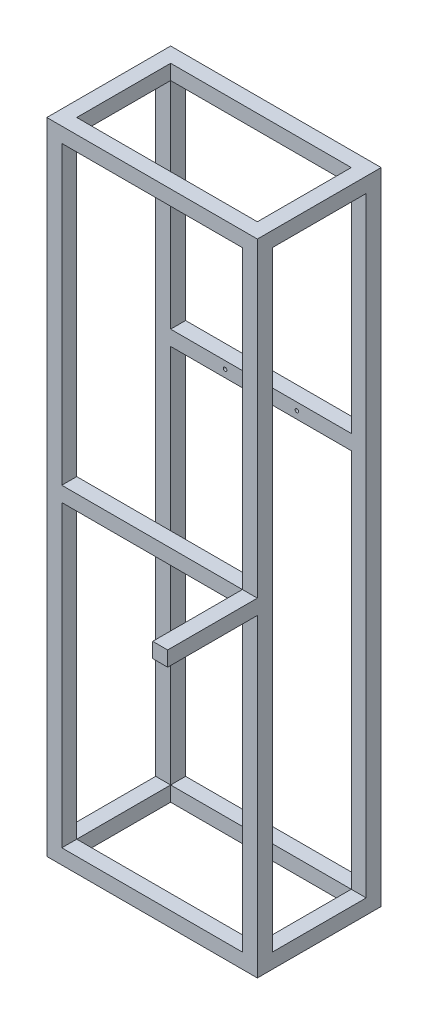
ISO-10303-21;
HEADER;
FILE_DESCRIPTION(('STEP AP214'),'2;1');
FILE_NAME('part.step','',(''),(''),'','','');
FILE_SCHEMA(('AUTOMOTIVE_DESIGN { 1 0 10303 214 1 1 1 1 }'));
ENDSEC;
DATA;
#1=APPLICATION_CONTEXT('core data for automotive mechanical design processes');
#2=APPLICATION_PROTOCOL_DEFINITION('international standard','automotive_design',2000,#1);
#3=PRODUCT_CONTEXT('',#1,'mechanical');
#4=PRODUCT('Part','Part','',(#3));
#5=PRODUCT_RELATED_PRODUCT_CATEGORY('part','',(#4));
#6=PRODUCT_DEFINITION_FORMATION('','',#4);
#7=PRODUCT_DEFINITION_CONTEXT('part definition',#1,'design');
#8=PRODUCT_DEFINITION('design','',#6,#7);
#9=PRODUCT_DEFINITION_SHAPE('','',#8);
#10=(LENGTH_UNIT() NAMED_UNIT(*) SI_UNIT(.MILLI.,.METRE.));
#11=(NAMED_UNIT(*) PLANE_ANGLE_UNIT() SI_UNIT($,.RADIAN.));
#12=(NAMED_UNIT(*) SI_UNIT($,.STERADIAN.) SOLID_ANGLE_UNIT());
#13=UNCERTAINTY_MEASURE_WITH_UNIT(LENGTH_MEASURE(1.E-05),#10,'distance_accuracy_value','');
#14=(GEOMETRIC_REPRESENTATION_CONTEXT(3) GLOBAL_UNCERTAINTY_ASSIGNED_CONTEXT((#13)) GLOBAL_UNIT_ASSIGNED_CONTEXT((#10,
#11,#12)) REPRESENTATION_CONTEXT('',''));
#15=CARTESIAN_POINT('',(0.,0.,0.));
#16=DIRECTION('',(0.,0.,1.));
#17=DIRECTION('',(1.,0.,0.));
#18=AXIS2_PLACEMENT_3D('',#15,#16,#17);
#19=CARTESIAN_POINT('',(0.,25.,0.));
#20=DIRECTION('',(0.,0.,-1.));
#21=DIRECTION('',(-1.,0.,0.));
#22=AXIS2_PLACEMENT_3D('',#19,#20,#21);
#23=PLANE('',#22);
#24=DIRECTION('',(-1.,0.,0.));
#25=VECTOR('',#24,1.);
#26=CARTESIAN_POINT('',(327.,550.,0.));
#27=LINE('',#26,#25);
#28=CARTESIAN_POINT('',(352.,550.,0.));
#29=VERTEX_POINT('',#28);
#30=CARTESIAN_POINT('',(327.,550.,0.));
#31=VERTEX_POINT('',#30);
#32=EDGE_CURVE('E50',#29,#31,#27,.T.);
#33=ORIENTED_EDGE('',*,*,#32,.F.);
#34=DIRECTION('',(0.,-1.,0.));
#35=VECTOR('',#34,1.);
#36=CARTESIAN_POINT('',(352.,25.,0.));
#37=LINE('',#36,#35);
#38=CARTESIAN_POINT('',(352.,1070.,0.));
#39=VERTEX_POINT('',#38);
#40=EDGE_CURVE('E510',#39,#29,#37,.T.);
#41=ORIENTED_EDGE('',*,*,#40,.F.);
#42=DIRECTION('',(1.,0.,0.));
#43=VECTOR('',#42,1.);
#44=CARTESIAN_POINT('',(0.,1070.,0.));
#45=LINE('',#44,#43);
#46=CARTESIAN_POINT('',(0.,1070.,0.));
#47=VERTEX_POINT('',#46);
#48=EDGE_CURVE('E409',#47,#39,#45,.T.);
#49=ORIENTED_EDGE('',*,*,#48,.F.);
#50=DIRECTION('',(0.,-1.,0.));
#51=VECTOR('',#50,1.);
#52=CARTESIAN_POINT('',(0.,25.,0.));
#53=LINE('',#52,#51);
#54=CARTESIAN_POINT('',(0.,0.,0.));
#55=VERTEX_POINT('',#54);
#56=EDGE_CURVE('E43',#47,#55,#53,.T.);
#57=ORIENTED_EDGE('',*,*,#56,.T.);
#58=DIRECTION('',(1.,0.,0.));
#59=VECTOR('',#58,1.);
#60=CARTESIAN_POINT('',(0.,0.,0.));
#61=LINE('',#60,#59);
#62=CARTESIAN_POINT('',(352.,0.,0.));
#63=VERTEX_POINT('',#62);
#64=EDGE_CURVE('E498',#55,#63,#61,.T.);
#65=ORIENTED_EDGE('',*,*,#64,.T.);
#66=CARTESIAN_POINT('',(352.,525.,0.));
#67=VERTEX_POINT('',#66);
#68=EDGE_CURVE('E509',#67,#63,#37,.T.);
#69=ORIENTED_EDGE('',*,*,#68,.F.);
#70=DIRECTION('',(1.,0.,0.));
#71=VECTOR('',#70,1.);
#72=CARTESIAN_POINT('',(327.,525.,0.));
#73=LINE('',#72,#71);
#74=CARTESIAN_POINT('',(327.,525.,0.));
#75=VERTEX_POINT('',#74);
#76=EDGE_CURVE('E528',#75,#67,#73,.T.);
#77=ORIENTED_EDGE('',*,*,#76,.F.);
#78=DIRECTION('',(0.,-1.,0.));
#79=VECTOR('',#78,1.);
#80=CARTESIAN_POINT('',(327.,1070.,0.));
#81=LINE('',#80,#79);
#82=CARTESIAN_POINT('',(327.,25.,0.));
#83=VERTEX_POINT('',#82);
#84=EDGE_CURVE('E394',#75,#83,#81,.T.);
#85=ORIENTED_EDGE('',*,*,#84,.T.);
#86=DIRECTION('',(1.,0.,0.));
#87=VECTOR('',#86,1.);
#88=CARTESIAN_POINT('',(0.,25.,0.));
#89=LINE('',#88,#87);
#90=CARTESIAN_POINT('',(25.,25.,0.));
#91=VERTEX_POINT('',#90);
#92=EDGE_CURVE('E485',#91,#83,#89,.T.);
#93=ORIENTED_EDGE('',*,*,#92,.F.);
#94=DIRECTION('',(0.,-1.,0.));
#95=VECTOR('',#94,1.);
#96=CARTESIAN_POINT('',(25.,1070.,0.));
#97=LINE('',#96,#95);
#98=CARTESIAN_POINT('',(25.,525.,0.));
#99=VERTEX_POINT('',#98);
#100=EDGE_CURVE('E422',#99,#91,#97,.T.);
#101=ORIENTED_EDGE('',*,*,#100,.F.);
#102=DIRECTION('',(1.,0.,0.));
#103=VECTOR('',#102,1.);
#104=CARTESIAN_POINT('',(25.,525.,0.));
#105=LINE('',#104,#103);
#106=EDGE_CURVE('E264',#99,#75,#105,.T.);
#107=ORIENTED_EDGE('',*,*,#106,.T.);
#108=DIRECTION('',(0.,-1.,0.));
#109=VECTOR('',#108,1.);
#110=CARTESIAN_POINT('',(327.,550.,0.));
#111=LINE('',#110,#109);
#112=EDGE_CURVE('E263',#31,#75,#111,.T.);
#113=ORIENTED_EDGE('',*,*,#112,.F.);
#114=DIRECTION('',(-1.,0.,0.));
#115=VECTOR('',#114,1.);
#116=CARTESIAN_POINT('',(25.,550.,0.));
#117=LINE('',#116,#115);
#118=CARTESIAN_POINT('',(25.,550.,0.));
#119=VERTEX_POINT('',#118);
#120=EDGE_CURVE('E267',#31,#119,#117,.T.);
#121=ORIENTED_EDGE('',*,*,#120,.T.);
#122=CARTESIAN_POINT('',(25.,1045.,0.));
#123=VERTEX_POINT('',#122);
#124=EDGE_CURVE('E423',#123,#119,#97,.T.);
#125=ORIENTED_EDGE('',*,*,#124,.F.);
#126=DIRECTION('',(1.,0.,0.));
#127=VECTOR('',#126,1.);
#128=CARTESIAN_POINT('',(352.,1045.,0.));
#129=LINE('',#128,#127);
#130=CARTESIAN_POINT('',(327.,1045.,0.));
#131=VERTEX_POINT('',#130);
#132=EDGE_CURVE('E344',#123,#131,#129,.T.);
#133=ORIENTED_EDGE('',*,*,#132,.T.);
#134=EDGE_CURVE('E400',#131,#31,#81,.T.);
#135=ORIENTED_EDGE('',*,*,#134,.T.);
#136=EDGE_LOOP('',(#33,#41,#49,#57,#65,#69,#77,#85,#93,#101,#107,#113,#121,#125,#133,#135));
#137=FACE_BOUND('',#136,.T.);
#138=ADVANCED_FACE('F35',(#137),#23,.F.);
#139=CARTESIAN_POINT('',(25.,1070.,0.));
#140=DIRECTION('',(-1.,0.,0.));
#141=DIRECTION('',(0.,0.,1.));
#142=AXIS2_PLACEMENT_3D('',#139,#140,#141);
#143=PLANE('',#142);
#144=ORIENTED_EDGE('',*,*,#124,.T.);
#145=DIRECTION('',(0.,0.,1.));
#146=VECTOR('',#145,1.);
#147=CARTESIAN_POINT('',(25.,550.,-25.));
#148=LINE('',#147,#146);
#149=CARTESIAN_POINT('',(25.,550.,-25.));
#150=VERTEX_POINT('',#149);
#151=EDGE_CURVE('E279',#150,#119,#148,.T.);
#152=ORIENTED_EDGE('',*,*,#151,.F.);
#153=DIRECTION('',(0.,-1.,0.));
#154=VECTOR('',#153,1.);
#155=CARTESIAN_POINT('',(25.,1070.,-25.));
#156=LINE('',#155,#154);
#157=CARTESIAN_POINT('',(25.,1045.,-25.));
#158=VERTEX_POINT('',#157);
#159=EDGE_CURVE('E419',#158,#150,#156,.T.);
#160=ORIENTED_EDGE('',*,*,#159,.F.);
#161=DIRECTION('',(0.,0.,1.));
#162=VECTOR('',#161,1.);
#163=CARTESIAN_POINT('',(25.,1045.,0.));
#164=LINE('',#163,#162);
#165=EDGE_CURVE('E365',#158,#123,#164,.T.);
#166=ORIENTED_EDGE('',*,*,#165,.T.);
#167=EDGE_LOOP('',(#144,#152,#160,#166));
#168=FACE_BOUND('',#167,.T.);
#169=ADVANCED_FACE('F554',(#168),#143,.F.);
#170=CARTESIAN_POINT('',(327.,1070.,0.));
#171=DIRECTION('',(1.,0.,0.));
#172=DIRECTION('',(0.,0.,-1.));
#173=AXIS2_PLACEMENT_3D('',#170,#171,#172);
#174=PLANE('',#173);
#175=DIRECTION('',(0.,-1.,0.));
#176=VECTOR('',#175,1.);
#177=CARTESIAN_POINT('',(327.,1070.,-25.));
#178=LINE('',#177,#176);
#179=CARTESIAN_POINT('',(327.,1045.,-25.));
#180=VERTEX_POINT('',#179);
#181=CARTESIAN_POINT('',(327.,550.,-25.));
#182=VERTEX_POINT('',#181);
#183=EDGE_CURVE('E403',#180,#182,#178,.T.);
#184=ORIENTED_EDGE('',*,*,#183,.T.);
#185=DIRECTION('',(0.,0.,1.));
#186=VECTOR('',#185,1.);
#187=CARTESIAN_POINT('',(327.,550.,-25.));
#188=LINE('',#187,#186);
#189=EDGE_CURVE('E282',#182,#31,#188,.T.);
#190=ORIENTED_EDGE('',*,*,#189,.T.);
#191=ORIENTED_EDGE('',*,*,#134,.F.);
#192=DIRECTION('',(0.,0.,-1.));
#193=VECTOR('',#192,1.);
#194=CARTESIAN_POINT('',(327.,1045.,0.));
#195=LINE('',#194,#193);
#196=EDGE_CURVE('E356',#131,#180,#195,.T.);
#197=ORIENTED_EDGE('',*,*,#196,.T.);
#198=EDGE_LOOP('',(#184,#190,#191,#197));
#199=FACE_BOUND('',#198,.T.);
#200=ADVANCED_FACE('F564',(#199),#174,.F.);
#201=CARTESIAN_POINT('',(25.,1070.,-207.));
#202=DIRECTION('',(-1.,0.,0.));
#203=DIRECTION('',(0.,0.,1.));
#204=AXIS2_PLACEMENT_3D('',#201,#202,#203);
#205=PLANE('',#204);
#206=DIRECTION('',(0.,-1.,0.));
#207=VECTOR('',#206,1.);
#208=CARTESIAN_POINT('',(25.,1070.,-182.));
#209=LINE('',#208,#207);
#210=CARTESIAN_POINT('',(25.,1045.,-182.));
#211=VERTEX_POINT('',#210);
#212=CARTESIAN_POINT('',(25.,684.999999999999,-182.));
#213=VERTEX_POINT('',#212);
#214=EDGE_CURVE('E442',#211,#213,#209,.T.);
#215=ORIENTED_EDGE('',*,*,#214,.T.);
#216=DIRECTION('',(0.,0.,-1.));
#217=VECTOR('',#216,1.);
#218=CARTESIAN_POINT('',(25.,684.999999999999,-182.));
#219=LINE('',#218,#217);
#220=CARTESIAN_POINT('',(25.,684.999999999999,-207.));
#221=VERTEX_POINT('',#220);
#222=EDGE_CURVE('E302',#213,#221,#219,.T.);
#223=ORIENTED_EDGE('',*,*,#222,.T.);
#224=DIRECTION('',(0.,-1.,0.));
#225=VECTOR('',#224,1.);
#226=CARTESIAN_POINT('',(25.,1070.,-207.));
#227=LINE('',#226,#225);
#228=CARTESIAN_POINT('',(25.,1045.,-207.));
#229=VERTEX_POINT('',#228);
#230=EDGE_CURVE('E438',#229,#221,#227,.T.);
#231=ORIENTED_EDGE('',*,*,#230,.F.);
#232=DIRECTION('',(0.,0.,1.));
#233=VECTOR('',#232,1.);
#234=CARTESIAN_POINT('',(25.,1045.,-207.));
#235=LINE('',#234,#233);
#236=EDGE_CURVE('E368',#229,#211,#235,.T.);
#237=ORIENTED_EDGE('',*,*,#236,.T.);
#238=EDGE_LOOP('',(#215,#223,#231,#237));
#239=FACE_BOUND('',#238,.T.);
#240=ADVANCED_FACE('F558',(#239),#205,.F.);
#241=CARTESIAN_POINT('',(327.,1070.,-207.));
#242=DIRECTION('',(1.,0.,0.));
#243=DIRECTION('',(0.,0.,-1.));
#244=AXIS2_PLACEMENT_3D('',#241,#242,#243);
#245=PLANE('',#244);
#246=DIRECTION('',(0.,-1.,0.));
#247=VECTOR('',#246,1.);
#248=CARTESIAN_POINT('',(327.,1070.,-207.));
#249=LINE('',#248,#247);
#250=CARTESIAN_POINT('',(327.,1045.,-207.));
#251=VERTEX_POINT('',#250);
#252=CARTESIAN_POINT('',(327.,684.999999999999,-207.));
#253=VERTEX_POINT('',#252);
#254=EDGE_CURVE('E387',#251,#253,#249,.T.);
#255=ORIENTED_EDGE('',*,*,#254,.T.);
#256=DIRECTION('',(0.,0.,-1.));
#257=VECTOR('',#256,1.);
#258=CARTESIAN_POINT('',(327.,684.999999999999,-182.));
#259=LINE('',#258,#257);
#260=CARTESIAN_POINT('',(327.,684.999999999999,-182.));
#261=VERTEX_POINT('',#260);
#262=EDGE_CURVE('E299',#261,#253,#259,.T.);
#263=ORIENTED_EDGE('',*,*,#262,.F.);
#264=DIRECTION('',(0.,-1.,0.));
#265=VECTOR('',#264,1.);
#266=CARTESIAN_POINT('',(327.,1070.,-182.));
#267=LINE('',#266,#265);
#268=CARTESIAN_POINT('',(327.,1045.,-182.));
#269=VERTEX_POINT('',#268);
#270=EDGE_CURVE('E383',#269,#261,#267,.T.);
#271=ORIENTED_EDGE('',*,*,#270,.F.);
#272=DIRECTION('',(0.,0.,-1.));
#273=VECTOR('',#272,1.);
#274=CARTESIAN_POINT('',(327.,1045.,-207.));
#275=LINE('',#274,#273);
#276=EDGE_CURVE('E353',#269,#251,#275,.T.);
#277=ORIENTED_EDGE('',*,*,#276,.T.);
#278=EDGE_LOOP('',(#255,#263,#271,#277));
#279=FACE_BOUND('',#278,.T.);
#280=ADVANCED_FACE('F581',(#279),#245,.F.);
#281=CARTESIAN_POINT('',(0.,25.,0.));
#282=DIRECTION('',(0.,-1.,0.));
#283=DIRECTION('',(0.,0.,-1.));
#284=AXIS2_PLACEMENT_3D('',#281,#282,#283);
#285=PLANE('',#284);
#286=DIRECTION('',(0.,0.,1.));
#287=VECTOR('',#286,1.);
#288=CARTESIAN_POINT('',(327.,25.,-207.));
#289=LINE('',#288,#287);
#290=CARTESIAN_POINT('',(327.,25.,-207.));
#291=VERTEX_POINT('',#290);
#292=CARTESIAN_POINT('',(327.,25.,-182.));
#293=VERTEX_POINT('',#292);
#294=EDGE_CURVE('E374',#291,#293,#289,.T.);
#295=ORIENTED_EDGE('',*,*,#294,.F.);
#296=DIRECTION('',(-1.,0.,0.));
#297=VECTOR('',#296,1.);
#298=CARTESIAN_POINT('',(0.,25.,-207.));
#299=LINE('',#298,#297);
#300=CARTESIAN_POINT('',(25.,25.,-207.));
#301=VERTEX_POINT('',#300);
#302=EDGE_CURVE('E492',#291,#301,#299,.T.);
#303=ORIENTED_EDGE('',*,*,#302,.T.);
#304=DIRECTION('',(0.,0.,-1.));
#305=VECTOR('',#304,1.);
#306=CARTESIAN_POINT('',(25.,25.,-207.));
#307=LINE('',#306,#305);
#308=CARTESIAN_POINT('',(25.,25.,-182.));
#309=VERTEX_POINT('',#308);
#310=EDGE_CURVE('E430',#309,#301,#307,.T.);
#311=ORIENTED_EDGE('',*,*,#310,.F.);
#312=DIRECTION('',(-1.,0.,0.));
#313=VECTOR('',#312,1.);
#314=CARTESIAN_POINT('',(25.,25.,-182.));
#315=LINE('',#314,#313);
#316=EDGE_CURVE('E458',#293,#309,#315,.T.);
#317=ORIENTED_EDGE('',*,*,#316,.F.);
#318=EDGE_LOOP('',(#295,#303,#311,#317));
#319=FACE_BOUND('',#318,.T.);
#320=ADVANCED_FACE('F577',(#319),#285,.F.);
#321=DIRECTION('',(1.,0.,0.));
#322=VECTOR('',#321,1.);
#323=CARTESIAN_POINT('',(352.,25.,-182.));
#324=LINE('',#323,#322);
#325=CARTESIAN_POINT('',(352.,25.,-182.));
#326=VERTEX_POINT('',#325);
#327=EDGE_CURVE('E377',#293,#326,#324,.T.);
#328=ORIENTED_EDGE('',*,*,#327,.F.);
#329=DIRECTION('',(0.,0.,-1.));
#330=VECTOR('',#329,1.);
#331=CARTESIAN_POINT('',(327.,25.,-25.));
#332=LINE('',#331,#330);
#333=CARTESIAN_POINT('',(327.,25.,-25.));
#334=VERTEX_POINT('',#333);
#335=EDGE_CURVE('E455',#334,#293,#332,.T.);
#336=ORIENTED_EDGE('',*,*,#335,.F.);
#337=DIRECTION('',(-1.,0.,0.));
#338=VECTOR('',#337,1.);
#339=CARTESIAN_POINT('',(352.,25.,-25.));
#340=LINE('',#339,#338);
#341=CARTESIAN_POINT('',(352.,25.,-25.));
#342=VERTEX_POINT('',#341);
#343=EDGE_CURVE('E390',#342,#334,#340,.T.);
#344=ORIENTED_EDGE('',*,*,#343,.F.);
#345=DIRECTION('',(0.,0.,-1.));
#346=VECTOR('',#345,1.);
#347=CARTESIAN_POINT('',(352.,25.,0.));
#348=LINE('',#347,#346);
#349=EDGE_CURVE('E489',#342,#326,#348,.T.);
#350=ORIENTED_EDGE('',*,*,#349,.T.);
#351=EDGE_LOOP('',(#328,#336,#344,#350));
#352=FACE_BOUND('',#351,.T.);
#353=ADVANCED_FACE('F580',(#352),#285,.F.);
#354=DIRECTION('',(0.,0.,1.));
#355=VECTOR('',#354,1.);
#356=CARTESIAN_POINT('',(327.,25.,0.));
#357=LINE('',#356,#355);
#358=EDGE_CURVE('E395',#334,#83,#357,.T.);
#359=ORIENTED_EDGE('',*,*,#358,.F.);
#360=DIRECTION('',(1.,0.,0.));
#361=VECTOR('',#360,1.);
#362=CARTESIAN_POINT('',(25.,25.,-25.));
#363=LINE('',#362,#361);
#364=CARTESIAN_POINT('',(25.,25.,-25.));
#365=VERTEX_POINT('',#364);
#366=EDGE_CURVE('E451',#365,#334,#363,.T.);
#367=ORIENTED_EDGE('',*,*,#366,.F.);
#368=DIRECTION('',(0.,0.,-1.));
#369=VECTOR('',#368,1.);
#370=CARTESIAN_POINT('',(25.,25.,0.));
#371=LINE('',#370,#369);
#372=EDGE_CURVE('E408',#91,#365,#371,.T.);
#373=ORIENTED_EDGE('',*,*,#372,.F.);
#374=ORIENTED_EDGE('',*,*,#92,.T.);
#375=EDGE_LOOP('',(#359,#367,#373,#374));
#376=FACE_BOUND('',#375,.T.);
#377=ADVANCED_FACE('F693',(#376),#285,.F.);
#378=DIRECTION('',(-1.,0.,0.));
#379=VECTOR('',#378,1.);
#380=CARTESIAN_POINT('',(0.,25.,-25.));
#381=LINE('',#380,#379);
#382=CARTESIAN_POINT('',(0.,25.,-25.));
#383=VERTEX_POINT('',#382);
#384=EDGE_CURVE('E412',#365,#383,#381,.T.);
#385=ORIENTED_EDGE('',*,*,#384,.F.);
#386=DIRECTION('',(0.,0.,1.));
#387=VECTOR('',#386,1.);
#388=CARTESIAN_POINT('',(25.,25.,-25.));
#389=LINE('',#388,#387);
#390=EDGE_CURVE('E448',#309,#365,#389,.T.);
#391=ORIENTED_EDGE('',*,*,#390,.F.);
#392=DIRECTION('',(1.,0.,0.));
#393=VECTOR('',#392,1.);
#394=CARTESIAN_POINT('',(0.,25.,-182.));
#395=LINE('',#394,#393);
#396=CARTESIAN_POINT('',(0.,25.,-182.));
#397=VERTEX_POINT('',#396);
#398=EDGE_CURVE('E426',#397,#309,#395,.T.);
#399=ORIENTED_EDGE('',*,*,#398,.F.);
#400=DIRECTION('',(0.,0.,1.));
#401=VECTOR('',#400,1.);
#402=CARTESIAN_POINT('',(0.,25.,0.));
#403=LINE('',#402,#401);
#404=EDGE_CURVE('E482',#397,#383,#403,.T.);
#405=ORIENTED_EDGE('',*,*,#404,.T.);
#406=EDGE_LOOP('',(#385,#391,#399,#405));
#407=FACE_BOUND('',#406,.T.);
#408=ADVANCED_FACE('F576',(#407),#285,.F.);
#409=CARTESIAN_POINT('',(0.,0.,0.));
#410=DIRECTION('',(0.,-1.,0.));
#411=DIRECTION('',(0.,0.,-1.));
#412=AXIS2_PLACEMENT_3D('',#409,#410,#411);
#413=PLANE('',#412);
#414=DIRECTION('',(0.,0.,1.));
#415=VECTOR('',#414,1.);
#416=CARTESIAN_POINT('',(0.,0.,0.));
#417=LINE('',#416,#415);
#418=CARTESIAN_POINT('',(0.,0.,-207.));
#419=VERTEX_POINT('',#418);
#420=EDGE_CURVE('E481',#419,#55,#417,.T.);
#421=ORIENTED_EDGE('',*,*,#420,.F.);
#422=DIRECTION('',(-1.,0.,0.));
#423=VECTOR('',#422,1.);
#424=CARTESIAN_POINT('',(0.,0.,-207.));
#425=LINE('',#424,#423);
#426=CARTESIAN_POINT('',(352.,0.,-207.));
#427=VERTEX_POINT('',#426);
#428=EDGE_CURVE('E486',#427,#419,#425,.T.);
#429=ORIENTED_EDGE('',*,*,#428,.F.);
#430=DIRECTION('',(0.,0.,-1.));
#431=VECTOR('',#430,1.);
#432=CARTESIAN_POINT('',(352.,0.,0.));
#433=LINE('',#432,#431);
#434=EDGE_CURVE('E501',#63,#427,#433,.T.);
#435=ORIENTED_EDGE('',*,*,#434,.F.);
#436=ORIENTED_EDGE('',*,*,#64,.F.);
#437=EDGE_LOOP('',(#421,#429,#435,#436));
#438=FACE_BOUND('',#437,.T.);
#439=DIRECTION('',(-1.,0.,0.));
#440=VECTOR('',#439,1.);
#441=CARTESIAN_POINT('',(25.,0.,-182.));
#442=LINE('',#441,#440);
#443=CARTESIAN_POINT('',(327.,0.,-182.));
#444=VERTEX_POINT('',#443);
#445=CARTESIAN_POINT('',(25.,0.,-182.));
#446=VERTEX_POINT('',#445);
#447=EDGE_CURVE('E452',#444,#446,#442,.T.);
#448=ORIENTED_EDGE('',*,*,#447,.T.);
#449=DIRECTION('',(0.,0.,1.));
#450=VECTOR('',#449,1.);
#451=CARTESIAN_POINT('',(25.,0.,-25.));
#452=LINE('',#451,#450);
#453=CARTESIAN_POINT('',(25.,0.,-25.));
#454=VERTEX_POINT('',#453);
#455=EDGE_CURVE('E447',#446,#454,#452,.T.);
#456=ORIENTED_EDGE('',*,*,#455,.T.);
#457=DIRECTION('',(1.,0.,0.));
#458=VECTOR('',#457,1.);
#459=CARTESIAN_POINT('',(25.,0.,-25.));
#460=LINE('',#459,#458);
#461=CARTESIAN_POINT('',(327.,0.,-25.));
#462=VERTEX_POINT('',#461);
#463=EDGE_CURVE('E464',#454,#462,#460,.T.);
#464=ORIENTED_EDGE('',*,*,#463,.T.);
#465=DIRECTION('',(0.,0.,-1.));
#466=VECTOR('',#465,1.);
#467=CARTESIAN_POINT('',(327.,0.,-25.));
#468=LINE('',#467,#466);
#469=EDGE_CURVE('E467',#462,#444,#468,.T.);
#470=ORIENTED_EDGE('',*,*,#469,.T.);
#471=EDGE_LOOP('',(#448,#456,#464,#470));
#472=FACE_BOUND('',#471,.T.);
#473=ADVANCED_FACE('F519',(#438,#472),#413,.T.);
#474=CARTESIAN_POINT('',(0.,25.,0.));
#475=DIRECTION('',(1.,0.,0.));
#476=DIRECTION('',(0.,0.,-1.));
#477=AXIS2_PLACEMENT_3D('',#474,#475,#476);
#478=PLANE('',#477);
#479=DIRECTION('',(0.,0.,1.));
#480=VECTOR('',#479,1.);
#481=CARTESIAN_POINT('',(0.,1045.,0.));
#482=LINE('',#481,#480);
#483=CARTESIAN_POINT('',(0.,1045.,-182.));
#484=VERTEX_POINT('',#483);
#485=CARTESIAN_POINT('',(0.,1045.,-25.));
#486=VERTEX_POINT('',#485);
#487=EDGE_CURVE('E335',#484,#486,#482,.T.);
#488=ORIENTED_EDGE('',*,*,#487,.T.);
#489=DIRECTION('',(0.,-1.,0.));
#490=VECTOR('',#489,1.);
#491=CARTESIAN_POINT('',(0.,1070.,-25.));
#492=LINE('',#491,#490);
#493=EDGE_CURVE('E411',#486,#383,#492,.T.);
#494=ORIENTED_EDGE('',*,*,#493,.T.);
#495=ORIENTED_EDGE('',*,*,#404,.F.);
#496=DIRECTION('',(0.,-1.,0.));
#497=VECTOR('',#496,1.);
#498=CARTESIAN_POINT('',(0.,1070.,-182.));
#499=LINE('',#498,#497);
#500=EDGE_CURVE('E445',#484,#397,#499,.T.);
#501=ORIENTED_EDGE('',*,*,#500,.F.);
#502=EDGE_LOOP('',(#488,#494,#495,#501));
#503=FACE_BOUND('',#502,.T.);
#504=ORIENTED_EDGE('',*,*,#420,.T.);
#505=ORIENTED_EDGE('',*,*,#56,.F.);
#506=DIRECTION('',(0.,0.,1.));
#507=VECTOR('',#506,1.);
#508=CARTESIAN_POINT('',(0.,1070.,-207.));
#509=LINE('',#508,#507);
#510=CARTESIAN_POINT('',(0.,1070.,-207.));
#511=VERTEX_POINT('',#510);
#512=EDGE_CURVE('E427',#511,#47,#509,.T.);
#513=ORIENTED_EDGE('',*,*,#512,.F.);
#514=DIRECTION('',(0.,-1.,0.));
#515=VECTOR('',#514,1.);
#516=CARTESIAN_POINT('',(0.,25.,-207.));
#517=LINE('',#516,#515);
#518=EDGE_CURVE('E495',#511,#419,#517,.T.);
#519=ORIENTED_EDGE('',*,*,#518,.T.);
#520=EDGE_LOOP('',(#504,#505,#513,#519));
#521=FACE_BOUND('',#520,.T.);
#522=ADVANCED_FACE('F37',(#503,#521),#478,.F.);
#523=CARTESIAN_POINT('',(352.,25.,0.));
#524=DIRECTION('',(-1.,0.,0.));
#525=DIRECTION('',(0.,0.,1.));
#526=AXIS2_PLACEMENT_3D('',#523,#524,#525);
#527=PLANE('',#526);
#528=DIRECTION('',(0.,0.,-1.));
#529=VECTOR('',#528,1.);
#530=CARTESIAN_POINT('',(352.,1045.,-207.));
#531=LINE('',#530,#529);
#532=CARTESIAN_POINT('',(352.,1045.,-25.));
#533=VERTEX_POINT('',#532);
#534=CARTESIAN_POINT('',(352.,1045.,-182.));
#535=VERTEX_POINT('',#534);
#536=EDGE_CURVE('E347',#533,#535,#531,.T.);
#537=ORIENTED_EDGE('',*,*,#536,.T.);
#538=DIRECTION('',(0.,-1.,0.));
#539=VECTOR('',#538,1.);
#540=CARTESIAN_POINT('',(352.,1070.,-182.));
#541=LINE('',#540,#539);
#542=EDGE_CURVE('E380',#535,#326,#541,.T.);
#543=ORIENTED_EDGE('',*,*,#542,.T.);
#544=ORIENTED_EDGE('',*,*,#349,.F.);
#545=DIRECTION('',(0.,-1.,0.));
#546=VECTOR('',#545,1.);
#547=CARTESIAN_POINT('',(352.,1070.,-25.));
#548=LINE('',#547,#546);
#549=EDGE_CURVE('E406',#533,#342,#548,.T.);
#550=ORIENTED_EDGE('',*,*,#549,.F.);
#551=EDGE_LOOP('',(#537,#543,#544,#550));
#552=FACE_BOUND('',#551,.T.);
#553=ORIENTED_EDGE('',*,*,#434,.T.);
#554=DIRECTION('',(0.,-1.,0.));
#555=VECTOR('',#554,1.);
#556=CARTESIAN_POINT('',(352.,25.,-207.));
#557=LINE('',#556,#555);
#558=CARTESIAN_POINT('',(352.,1070.,-207.));
#559=VERTEX_POINT('',#558);
#560=EDGE_CURVE('E507',#559,#427,#557,.T.);
#561=ORIENTED_EDGE('',*,*,#560,.F.);
#562=DIRECTION('',(0.,0.,-1.));
#563=VECTOR('',#562,1.);
#564=CARTESIAN_POINT('',(352.,1070.,0.));
#565=LINE('',#564,#563);
#566=EDGE_CURVE('E391',#39,#559,#565,.T.);
#567=ORIENTED_EDGE('',*,*,#566,.F.);
#568=ORIENTED_EDGE('',*,*,#40,.T.);
#569=DIRECTION('',(0.,0.,-1.));
#570=VECTOR('',#569,1.);
#571=CARTESIAN_POINT('',(352.,550.,150.));
#572=LINE('',#571,#570);
#573=CARTESIAN_POINT('',(352.,550.,150.));
#574=VERTEX_POINT('',#573);
#575=EDGE_CURVE('E269',#574,#29,#572,.T.);
#576=ORIENTED_EDGE('',*,*,#575,.F.);
#577=DIRECTION('',(0.,1.,0.));
#578=VECTOR('',#577,1.);
#579=CARTESIAN_POINT('',(352.,550.,150.));
#580=LINE('',#579,#578);
#581=CARTESIAN_POINT('',(352.,525.,150.));
#582=VERTEX_POINT('',#581);
#583=EDGE_CURVE('E251',#582,#574,#580,.T.);
#584=ORIENTED_EDGE('',*,*,#583,.F.);
#585=DIRECTION('',(0.,0.,-1.));
#586=VECTOR('',#585,1.);
#587=CARTESIAN_POINT('',(352.,525.,150.));
#588=LINE('',#587,#586);
#589=EDGE_CURVE('E248',#582,#67,#588,.T.);
#590=ORIENTED_EDGE('',*,*,#589,.T.);
#591=ORIENTED_EDGE('',*,*,#68,.T.);
#592=EDGE_LOOP('',(#553,#561,#567,#568,#576,#584,#590,#591));
#593=FACE_BOUND('',#592,.T.);
#594=ADVANCED_FACE('F527',(#552,#593),#527,.F.);
#595=CARTESIAN_POINT('',(0.,25.,-207.));
#596=DIRECTION('',(0.,0.,1.));
#597=DIRECTION('',(1.,0.,0.));
#598=AXIS2_PLACEMENT_3D('',#595,#596,#597);
#599=PLANE('',#598);
#600=CARTESIAN_POINT('',(116.,672.499999999999,-207.));
#601=DIRECTION('',(0.,0.,-1.));
#602=DIRECTION('',(-1.,0.,0.));
#603=AXIS2_PLACEMENT_3D('',#600,#601,#602);
#604=CIRCLE('',#603,3.00000000000001);
#605=CARTESIAN_POINT('',(113.,672.499999999999,-207.));
#606=VERTEX_POINT('',#605);
#607=EDGE_CURVE('E1074',#606,#606,#604,.T.);
#608=ORIENTED_EDGE('',*,*,#607,.F.);
#609=EDGE_LOOP('',(#608));
#610=FACE_BOUND('',#609,.T.);
#611=CARTESIAN_POINT('',(236.,672.499999999999,-207.));
#612=DIRECTION('',(0.,0.,-1.));
#613=DIRECTION('',(-1.,0.,0.));
#614=AXIS2_PLACEMENT_3D('',#611,#612,#613);
#615=CIRCLE('',#614,2.99999999999999);
#616=CARTESIAN_POINT('',(233.,672.499999999999,-207.));
#617=VERTEX_POINT('',#616);
#618=EDGE_CURVE('E1075',#617,#617,#615,.T.);
#619=ORIENTED_EDGE('',*,*,#618,.F.);
#620=EDGE_LOOP('',(#619));
#621=FACE_BOUND('',#620,.T.);
#622=ORIENTED_EDGE('',*,*,#230,.T.);
#623=DIRECTION('',(1.,0.,0.));
#624=VECTOR('',#623,1.);
#625=CARTESIAN_POINT('',(327.,684.999999999999,-207.));
#626=LINE('',#625,#624);
#627=EDGE_CURVE('E293',#221,#253,#626,.T.);
#628=ORIENTED_EDGE('',*,*,#627,.T.);
#629=ORIENTED_EDGE('',*,*,#254,.F.);
#630=DIRECTION('',(-1.,0.,0.));
#631=VECTOR('',#630,1.);
#632=CARTESIAN_POINT('',(0.,1045.,-207.));
#633=LINE('',#632,#631);
#634=EDGE_CURVE('E350',#251,#229,#633,.T.);
#635=ORIENTED_EDGE('',*,*,#634,.T.);
#636=EDGE_LOOP('',(#622,#628,#629,#635));
#637=FACE_BOUND('',#636,.T.);
#638=DIRECTION('',(-1.,0.,0.));
#639=VECTOR('',#638,1.);
#640=CARTESIAN_POINT('',(327.,659.999999999999,-207.));
#641=LINE('',#640,#639);
#642=CARTESIAN_POINT('',(327.,659.999999999999,-207.));
#643=VERTEX_POINT('',#642);
#644=CARTESIAN_POINT('',(25.,659.999999999999,-207.));
#645=VERTEX_POINT('',#644);
#646=EDGE_CURVE('E281',#643,#645,#641,.T.);
#647=ORIENTED_EDGE('',*,*,#646,.T.);
#648=EDGE_CURVE('E433',#645,#301,#227,.T.);
#649=ORIENTED_EDGE('',*,*,#648,.T.);
#650=ORIENTED_EDGE('',*,*,#302,.F.);
#651=EDGE_CURVE('E386',#643,#291,#249,.T.);
#652=ORIENTED_EDGE('',*,*,#651,.F.);
#653=EDGE_LOOP('',(#647,#649,#650,#652));
#654=FACE_BOUND('',#653,.T.);
#655=ORIENTED_EDGE('',*,*,#428,.T.);
#656=ORIENTED_EDGE('',*,*,#518,.F.);
#657=DIRECTION('',(-1.,0.,0.));
#658=VECTOR('',#657,1.);
#659=CARTESIAN_POINT('',(0.,1070.,-207.));
#660=LINE('',#659,#658);
#661=EDGE_CURVE('E429',#559,#511,#660,.T.);
#662=ORIENTED_EDGE('',*,*,#661,.F.);
#663=ORIENTED_EDGE('',*,*,#560,.T.);
#664=EDGE_LOOP('',(#655,#656,#662,#663));
#665=FACE_BOUND('',#664,.T.);
#666=ADVANCED_FACE('F523',(#610,#621,#637,#654,#665),#599,.F.);
#667=CARTESIAN_POINT('',(25.,25.,-25.));
#668=DIRECTION('',(1.,0.,0.));
#669=DIRECTION('',(0.,0.,-1.));
#670=AXIS2_PLACEMENT_3D('',#667,#668,#669);
#671=PLANE('',#670);
#672=ORIENTED_EDGE('',*,*,#455,.F.);
#673=DIRECTION('',(0.,-1.,0.));
#674=VECTOR('',#673,1.);
#675=CARTESIAN_POINT('',(25.,25.,-182.));
#676=LINE('',#675,#674);
#677=EDGE_CURVE('E461',#309,#446,#676,.T.);
#678=ORIENTED_EDGE('',*,*,#677,.F.);
#679=ORIENTED_EDGE('',*,*,#390,.T.);
#680=DIRECTION('',(0.,-1.,0.));
#681=VECTOR('',#680,1.);
#682=CARTESIAN_POINT('',(25.,25.,-25.));
#683=LINE('',#682,#681);
#684=EDGE_CURVE('E478',#365,#454,#683,.T.);
#685=ORIENTED_EDGE('',*,*,#684,.T.);
#686=EDGE_LOOP('',(#672,#678,#679,#685));
#687=FACE_BOUND('',#686,.T.);
#688=ADVANCED_FACE('F572',(#687),#671,.T.);
#689=CARTESIAN_POINT('',(25.,25.,-25.));
#690=DIRECTION('',(0.,0.,-1.));
#691=DIRECTION('',(-1.,0.,0.));
#692=AXIS2_PLACEMENT_3D('',#689,#690,#691);
#693=PLANE('',#692);
#694=ORIENTED_EDGE('',*,*,#463,.F.);
#695=ORIENTED_EDGE('',*,*,#684,.F.);
#696=ORIENTED_EDGE('',*,*,#366,.T.);
#697=DIRECTION('',(0.,-1.,0.));
#698=VECTOR('',#697,1.);
#699=CARTESIAN_POINT('',(327.,25.,-25.));
#700=LINE('',#699,#698);
#701=EDGE_CURVE('E476',#334,#462,#700,.T.);
#702=ORIENTED_EDGE('',*,*,#701,.T.);
#703=EDGE_LOOP('',(#694,#695,#696,#702));
#704=FACE_BOUND('',#703,.T.);
#705=ADVANCED_FACE('F585',(#704),#693,.T.);
#706=CARTESIAN_POINT('',(327.,25.,-25.));
#707=DIRECTION('',(-1.,0.,0.));
#708=DIRECTION('',(0.,0.,1.));
#709=AXIS2_PLACEMENT_3D('',#706,#707,#708);
#710=PLANE('',#709);
#711=ORIENTED_EDGE('',*,*,#469,.F.);
#712=ORIENTED_EDGE('',*,*,#701,.F.);
#713=ORIENTED_EDGE('',*,*,#335,.T.);
#714=DIRECTION('',(0.,-1.,0.));
#715=VECTOR('',#714,1.);
#716=CARTESIAN_POINT('',(327.,25.,-182.));
#717=LINE('',#716,#715);
#718=EDGE_CURVE('E474',#293,#444,#717,.T.);
#719=ORIENTED_EDGE('',*,*,#718,.T.);
#720=EDGE_LOOP('',(#711,#712,#713,#719));
#721=FACE_BOUND('',#720,.T.);
#722=ADVANCED_FACE('F589',(#721),#710,.T.);
#723=CARTESIAN_POINT('',(25.,25.,-182.));
#724=DIRECTION('',(0.,0.,1.));
#725=DIRECTION('',(1.,0.,0.));
#726=AXIS2_PLACEMENT_3D('',#723,#724,#725);
#727=PLANE('',#726);
#728=ORIENTED_EDGE('',*,*,#447,.F.);
#729=ORIENTED_EDGE('',*,*,#718,.F.);
#730=ORIENTED_EDGE('',*,*,#316,.T.);
#731=ORIENTED_EDGE('',*,*,#677,.T.);
#732=EDGE_LOOP('',(#728,#729,#730,#731));
#733=FACE_BOUND('',#732,.T.);
#734=ADVANCED_FACE('F593',(#733),#727,.T.);
#735=CARTESIAN_POINT('',(0.,1070.,-182.));
#736=DIRECTION('',(0.,0.,-1.));
#737=DIRECTION('',(-1.,0.,0.));
#738=AXIS2_PLACEMENT_3D('',#735,#736,#737);
#739=PLANE('',#738);
#740=CARTESIAN_POINT('',(116.,672.499999999999,-182.));
#741=DIRECTION('',(0.,0.,-1.));
#742=DIRECTION('',(-1.,0.,0.));
#743=AXIS2_PLACEMENT_3D('',#740,#741,#742);
#744=CIRCLE('',#743,3.00000000000001);
#745=CARTESIAN_POINT('',(113.,672.499999999999,-182.));
#746=VERTEX_POINT('',#745);
#747=EDGE_CURVE('E605',#746,#746,#744,.F.);
#748=ORIENTED_EDGE('',*,*,#747,.F.);
#749=EDGE_LOOP('',(#748));
#750=FACE_BOUND('',#749,.T.);
#751=CARTESIAN_POINT('',(236.,672.499999999999,-182.));
#752=DIRECTION('',(0.,0.,-1.));
#753=DIRECTION('',(-1.,0.,0.));
#754=AXIS2_PLACEMENT_3D('',#751,#752,#753);
#755=CIRCLE('',#754,2.99999999999999);
#756=CARTESIAN_POINT('',(233.,672.499999999999,-182.));
#757=VERTEX_POINT('',#756);
#758=EDGE_CURVE('E531',#757,#757,#755,.F.);
#759=ORIENTED_EDGE('',*,*,#758,.F.);
#760=EDGE_LOOP('',(#759));
#761=FACE_BOUND('',#760,.T.);
#762=ORIENTED_EDGE('',*,*,#214,.F.);
#763=DIRECTION('',(-1.,0.,0.));
#764=VECTOR('',#763,1.);
#765=CARTESIAN_POINT('',(0.,1045.,-182.));
#766=LINE('',#765,#764);
#767=EDGE_CURVE('E371',#211,#484,#766,.T.);
#768=ORIENTED_EDGE('',*,*,#767,.T.);
#769=ORIENTED_EDGE('',*,*,#500,.T.);
#770=ORIENTED_EDGE('',*,*,#398,.T.);
#771=CARTESIAN_POINT('',(25.,659.999999999999,-182.));
#772=VERTEX_POINT('',#771);
#773=EDGE_CURVE('E441',#772,#309,#209,.T.);
#774=ORIENTED_EDGE('',*,*,#773,.F.);
#775=DIRECTION('',(-1.,0.,0.));
#776=VECTOR('',#775,1.);
#777=CARTESIAN_POINT('',(327.,659.999999999999,-182.));
#778=LINE('',#777,#776);
#779=CARTESIAN_POINT('',(327.,659.999999999999,-182.));
#780=VERTEX_POINT('',#779);
#781=EDGE_CURVE('E290',#780,#772,#778,.T.);
#782=ORIENTED_EDGE('',*,*,#781,.F.);
#783=EDGE_CURVE('E382',#780,#293,#267,.T.);
#784=ORIENTED_EDGE('',*,*,#783,.T.);
#785=ORIENTED_EDGE('',*,*,#327,.T.);
#786=ORIENTED_EDGE('',*,*,#542,.F.);
#787=DIRECTION('',(-1.,0.,0.));
#788=VECTOR('',#787,1.);
#789=CARTESIAN_POINT('',(352.,1045.,-182.));
#790=LINE('',#789,#788);
#791=EDGE_CURVE('E11',#535,#269,#790,.T.);
#792=ORIENTED_EDGE('',*,*,#791,.T.);
#793=ORIENTED_EDGE('',*,*,#270,.T.);
#794=DIRECTION('',(1.,0.,0.));
#795=VECTOR('',#794,1.);
#796=CARTESIAN_POINT('',(327.,684.999999999999,-182.));
#797=LINE('',#796,#795);
#798=EDGE_CURVE('E292',#213,#261,#797,.T.);
#799=ORIENTED_EDGE('',*,*,#798,.F.);
#800=EDGE_LOOP('',(#762,#768,#769,#770,#774,#782,#784,#785,#786,#792,#793,#799));
#801=FACE_BOUND('',#800,.T.);
#802=ADVANCED_FACE('F555',(#750,#761,#801),#739,.F.);
#803=ORIENTED_EDGE('',*,*,#648,.F.);
#804=DIRECTION('',(0.,0.,-1.));
#805=VECTOR('',#804,1.);
#806=CARTESIAN_POINT('',(25.,659.999999999999,-182.));
#807=LINE('',#806,#805);
#808=EDGE_CURVE('E305',#772,#645,#807,.T.);
#809=ORIENTED_EDGE('',*,*,#808,.F.);
#810=ORIENTED_EDGE('',*,*,#773,.T.);
#811=ORIENTED_EDGE('',*,*,#310,.T.);
#812=EDGE_LOOP('',(#803,#809,#810,#811));
#813=FACE_BOUND('',#812,.T.);
#814=ADVANCED_FACE('F544',(#813),#205,.F.);
#815=CARTESIAN_POINT('',(0.,1070.,0.));
#816=DIRECTION('',(0.,1.,0.));
#817=DIRECTION('',(0.,0.,1.));
#818=AXIS2_PLACEMENT_3D('',#815,#816,#817);
#819=PLANE('',#818);
#820=DIRECTION('',(0.,0.,1.));
#821=VECTOR('',#820,1.);
#822=CARTESIAN_POINT('',(25.,1070.,-182.));
#823=LINE('',#822,#821);
#824=CARTESIAN_POINT('',(25.,1070.,-182.));
#825=VERTEX_POINT('',#824);
#826=CARTESIAN_POINT('',(25.,1070.,-25.));
#827=VERTEX_POINT('',#826);
#828=EDGE_CURVE('E325',#825,#827,#823,.T.);
#829=ORIENTED_EDGE('',*,*,#828,.F.);
#830=DIRECTION('',(-1.,0.,0.));
#831=VECTOR('',#830,1.);
#832=CARTESIAN_POINT('',(327.,1070.,-182.));
#833=LINE('',#832,#831);
#834=CARTESIAN_POINT('',(327.,1070.,-182.));
#835=VERTEX_POINT('',#834);
#836=EDGE_CURVE('E301',#835,#825,#833,.T.);
#837=ORIENTED_EDGE('',*,*,#836,.F.);
#838=DIRECTION('',(0.,0.,-1.));
#839=VECTOR('',#838,1.);
#840=CARTESIAN_POINT('',(327.,1070.,-25.));
#841=LINE('',#840,#839);
#842=CARTESIAN_POINT('',(327.,1070.,-25.));
#843=VERTEX_POINT('',#842);
#844=EDGE_CURVE('E314',#843,#835,#841,.T.);
#845=ORIENTED_EDGE('',*,*,#844,.F.);
#846=DIRECTION('',(1.,0.,0.));
#847=VECTOR('',#846,1.);
#848=CARTESIAN_POINT('',(25.,1070.,-25.));
#849=LINE('',#848,#847);
#850=EDGE_CURVE('E328',#827,#843,#849,.T.);
#851=ORIENTED_EDGE('',*,*,#850,.F.);
#852=EDGE_LOOP('',(#829,#837,#845,#851));
#853=FACE_BOUND('',#852,.T.);
#854=ORIENTED_EDGE('',*,*,#512,.T.);
#855=ORIENTED_EDGE('',*,*,#48,.T.);
#856=ORIENTED_EDGE('',*,*,#566,.T.);
#857=ORIENTED_EDGE('',*,*,#661,.T.);
#858=EDGE_LOOP('',(#854,#855,#856,#857));
#859=FACE_BOUND('',#858,.T.);
#860=ADVANCED_FACE('F541',(#853,#859),#819,.T.);
#861=CARTESIAN_POINT('',(25.,525.,-25.));
#862=VERTEX_POINT('',#861);
#863=EDGE_CURVE('E418',#862,#365,#156,.T.);
#864=ORIENTED_EDGE('',*,*,#863,.F.);
#865=DIRECTION('',(0.,0.,1.));
#866=VECTOR('',#865,1.);
#867=CARTESIAN_POINT('',(25.,525.,-25.));
#868=LINE('',#867,#866);
#869=EDGE_CURVE('E275',#862,#99,#868,.T.);
#870=ORIENTED_EDGE('',*,*,#869,.T.);
#871=ORIENTED_EDGE('',*,*,#100,.T.);
#872=ORIENTED_EDGE('',*,*,#372,.T.);
#873=EDGE_LOOP('',(#864,#870,#871,#872));
#874=FACE_BOUND('',#873,.T.);
#875=ADVANCED_FACE('F543',(#874),#143,.F.);
#876=CARTESIAN_POINT('',(0.,1070.,-25.));
#877=DIRECTION('',(0.,0.,1.));
#878=DIRECTION('',(1.,0.,0.));
#879=AXIS2_PLACEMENT_3D('',#876,#877,#878);
#880=PLANE('',#879);
#881=ORIENTED_EDGE('',*,*,#493,.F.);
#882=DIRECTION('',(1.,0.,0.));
#883=VECTOR('',#882,1.);
#884=CARTESIAN_POINT('',(0.,1045.,-25.));
#885=LINE('',#884,#883);
#886=EDGE_CURVE('E362',#486,#158,#885,.T.);
#887=ORIENTED_EDGE('',*,*,#886,.T.);
#888=ORIENTED_EDGE('',*,*,#159,.T.);
#889=DIRECTION('',(-1.,0.,0.));
#890=VECTOR('',#889,1.);
#891=CARTESIAN_POINT('',(25.,550.,-25.));
#892=LINE('',#891,#890);
#893=EDGE_CURVE('E274',#182,#150,#892,.T.);
#894=ORIENTED_EDGE('',*,*,#893,.F.);
#895=ORIENTED_EDGE('',*,*,#183,.F.);
#896=DIRECTION('',(1.,0.,0.));
#897=VECTOR('',#896,1.);
#898=CARTESIAN_POINT('',(352.,1045.,-25.));
#899=LINE('',#898,#897);
#900=EDGE_CURVE('E359',#180,#533,#899,.T.);
#901=ORIENTED_EDGE('',*,*,#900,.T.);
#902=ORIENTED_EDGE('',*,*,#549,.T.);
#903=ORIENTED_EDGE('',*,*,#343,.T.);
#904=CARTESIAN_POINT('',(327.,525.,-25.));
#905=VERTEX_POINT('',#904);
#906=EDGE_CURVE('E402',#905,#334,#178,.T.);
#907=ORIENTED_EDGE('',*,*,#906,.F.);
#908=DIRECTION('',(1.,0.,0.));
#909=VECTOR('',#908,1.);
#910=CARTESIAN_POINT('',(25.,525.,-25.));
#911=LINE('',#910,#909);
#912=EDGE_CURVE('E58',#862,#905,#911,.T.);
#913=ORIENTED_EDGE('',*,*,#912,.F.);
#914=ORIENTED_EDGE('',*,*,#863,.T.);
#915=ORIENTED_EDGE('',*,*,#384,.T.);
#916=EDGE_LOOP('',(#881,#887,#888,#894,#895,#901,#902,#903,#907,#913,#914,#915));
#917=FACE_BOUND('',#916,.T.);
#918=ADVANCED_FACE('F551',(#917),#880,.F.);
#919=ORIENTED_EDGE('',*,*,#84,.F.);
#920=DIRECTION('',(0.,0.,1.));
#921=VECTOR('',#920,1.);
#922=CARTESIAN_POINT('',(327.,525.,-25.));
#923=LINE('',#922,#921);
#924=EDGE_CURVE('E285',#905,#75,#923,.T.);
#925=ORIENTED_EDGE('',*,*,#924,.F.);
#926=ORIENTED_EDGE('',*,*,#906,.T.);
#927=ORIENTED_EDGE('',*,*,#358,.T.);
#928=EDGE_LOOP('',(#919,#925,#926,#927));
#929=FACE_BOUND('',#928,.T.);
#930=ADVANCED_FACE('F699',(#929),#174,.F.);
#931=ORIENTED_EDGE('',*,*,#783,.F.);
#932=DIRECTION('',(0.,0.,-1.));
#933=VECTOR('',#932,1.);
#934=CARTESIAN_POINT('',(327.,659.999999999999,-182.));
#935=LINE('',#934,#933);
#936=EDGE_CURVE('E295',#780,#643,#935,.T.);
#937=ORIENTED_EDGE('',*,*,#936,.T.);
#938=ORIENTED_EDGE('',*,*,#651,.T.);
#939=ORIENTED_EDGE('',*,*,#294,.T.);
#940=EDGE_LOOP('',(#931,#937,#938,#939));
#941=FACE_BOUND('',#940,.T.);
#942=ADVANCED_FACE('F681',(#941),#245,.F.);
#943=CARTESIAN_POINT('',(0.,1045.,0.));
#944=DIRECTION('',(0.,-1.,0.));
#945=DIRECTION('',(0.,0.,-1.));
#946=AXIS2_PLACEMENT_3D('',#943,#944,#945);
#947=PLANE('',#946);
#948=ORIENTED_EDGE('',*,*,#767,.F.);
#949=DIRECTION('',(0.,0.,1.));
#950=VECTOR('',#949,1.);
#951=CARTESIAN_POINT('',(25.,1045.,-182.));
#952=LINE('',#951,#950);
#953=EDGE_CURVE('E313',#211,#158,#952,.T.);
#954=ORIENTED_EDGE('',*,*,#953,.T.);
#955=ORIENTED_EDGE('',*,*,#886,.F.);
#956=ORIENTED_EDGE('',*,*,#487,.F.);
#957=EDGE_LOOP('',(#948,#954,#955,#956));
#958=FACE_BOUND('',#957,.T.);
#959=ADVANCED_FACE('F663',(#958),#947,.T.);
#960=ORIENTED_EDGE('',*,*,#236,.F.);
#961=ORIENTED_EDGE('',*,*,#634,.F.);
#962=ORIENTED_EDGE('',*,*,#276,.F.);
#963=DIRECTION('',(-1.,0.,0.));
#964=VECTOR('',#963,1.);
#965=CARTESIAN_POINT('',(327.,1045.,-182.));
#966=LINE('',#965,#964);
#967=EDGE_CURVE('E310',#269,#211,#966,.T.);
#968=ORIENTED_EDGE('',*,*,#967,.T.);
#969=EDGE_LOOP('',(#960,#961,#962,#968));
#970=FACE_BOUND('',#969,.T.);
#971=ADVANCED_FACE('F615',(#970),#947,.T.);
#972=ORIENTED_EDGE('',*,*,#165,.F.);
#973=DIRECTION('',(1.,0.,0.));
#974=VECTOR('',#973,1.);
#975=CARTESIAN_POINT('',(25.,1045.,-25.));
#976=LINE('',#975,#974);
#977=EDGE_CURVE('E317',#158,#180,#976,.T.);
#978=ORIENTED_EDGE('',*,*,#977,.T.);
#979=ORIENTED_EDGE('',*,*,#196,.F.);
#980=ORIENTED_EDGE('',*,*,#132,.F.);
#981=EDGE_LOOP('',(#972,#978,#979,#980));
#982=FACE_BOUND('',#981,.T.);
#983=ADVANCED_FACE('F650',(#982),#947,.T.);
#984=ORIENTED_EDGE('',*,*,#900,.F.);
#985=DIRECTION('',(0.,0.,-1.));
#986=VECTOR('',#985,1.);
#987=CARTESIAN_POINT('',(327.,1045.,-25.));
#988=LINE('',#987,#986);
#989=EDGE_CURVE('E320',#180,#269,#988,.T.);
#990=ORIENTED_EDGE('',*,*,#989,.T.);
#991=ORIENTED_EDGE('',*,*,#791,.F.);
#992=ORIENTED_EDGE('',*,*,#536,.F.);
#993=EDGE_LOOP('',(#984,#990,#991,#992));
#994=FACE_BOUND('',#993,.T.);
#995=ADVANCED_FACE('F634',(#994),#947,.T.);
#996=CARTESIAN_POINT('',(327.,1045.,-182.));
#997=DIRECTION('',(0.,0.,-1.));
#998=DIRECTION('',(-1.,0.,0.));
#999=AXIS2_PLACEMENT_3D('',#996,#997,#998);
#1000=PLANE('',#999);
#1001=ORIENTED_EDGE('',*,*,#836,.T.);
#1002=DIRECTION('',(0.,1.,0.));
#1003=VECTOR('',#1002,1.);
#1004=CARTESIAN_POINT('',(25.,1045.,-182.));
#1005=LINE('',#1004,#1003);
#1006=EDGE_CURVE('E323',#211,#825,#1005,.T.);
#1007=ORIENTED_EDGE('',*,*,#1006,.F.);
#1008=ORIENTED_EDGE('',*,*,#967,.F.);
#1009=DIRECTION('',(0.,1.,0.));
#1010=VECTOR('',#1009,1.);
#1011=CARTESIAN_POINT('',(327.,1045.,-182.));
#1012=LINE('',#1011,#1010);
#1013=EDGE_CURVE('E333',#269,#835,#1012,.T.);
#1014=ORIENTED_EDGE('',*,*,#1013,.T.);
#1015=EDGE_LOOP('',(#1001,#1007,#1008,#1014));
#1016=FACE_BOUND('',#1015,.T.);
#1017=ADVANCED_FACE('F631',(#1016),#1000,.F.);
#1018=CARTESIAN_POINT('',(327.,1045.,-25.));
#1019=DIRECTION('',(1.,0.,0.));
#1020=DIRECTION('',(0.,0.,-1.));
#1021=AXIS2_PLACEMENT_3D('',#1018,#1019,#1020);
#1022=PLANE('',#1021);
#1023=ORIENTED_EDGE('',*,*,#844,.T.);
#1024=ORIENTED_EDGE('',*,*,#1013,.F.);
#1025=ORIENTED_EDGE('',*,*,#989,.F.);
#1026=DIRECTION('',(0.,1.,0.));
#1027=VECTOR('',#1026,1.);
#1028=CARTESIAN_POINT('',(327.,1045.,-25.));
#1029=LINE('',#1028,#1027);
#1030=EDGE_CURVE('E336',#180,#843,#1029,.T.);
#1031=ORIENTED_EDGE('',*,*,#1030,.T.);
#1032=EDGE_LOOP('',(#1023,#1024,#1025,#1031));
#1033=FACE_BOUND('',#1032,.T.);
#1034=ADVANCED_FACE('F626',(#1033),#1022,.F.);
#1035=CARTESIAN_POINT('',(25.,1045.,-25.));
#1036=DIRECTION('',(0.,0.,1.));
#1037=DIRECTION('',(1.,0.,0.));
#1038=AXIS2_PLACEMENT_3D('',#1035,#1036,#1037);
#1039=PLANE('',#1038);
#1040=ORIENTED_EDGE('',*,*,#850,.T.);
#1041=ORIENTED_EDGE('',*,*,#1030,.F.);
#1042=ORIENTED_EDGE('',*,*,#977,.F.);
#1043=DIRECTION('',(0.,1.,0.));
#1044=VECTOR('',#1043,1.);
#1045=CARTESIAN_POINT('',(25.,1045.,-25.));
#1046=LINE('',#1045,#1044);
#1047=EDGE_CURVE('E338',#158,#827,#1046,.T.);
#1048=ORIENTED_EDGE('',*,*,#1047,.T.);
#1049=EDGE_LOOP('',(#1040,#1041,#1042,#1048));
#1050=FACE_BOUND('',#1049,.T.);
#1051=ADVANCED_FACE('F658',(#1050),#1039,.F.);
#1052=CARTESIAN_POINT('',(25.,1045.,-182.));
#1053=DIRECTION('',(-1.,0.,0.));
#1054=DIRECTION('',(0.,0.,1.));
#1055=AXIS2_PLACEMENT_3D('',#1052,#1053,#1054);
#1056=PLANE('',#1055);
#1057=ORIENTED_EDGE('',*,*,#828,.T.);
#1058=ORIENTED_EDGE('',*,*,#1047,.F.);
#1059=ORIENTED_EDGE('',*,*,#953,.F.);
#1060=ORIENTED_EDGE('',*,*,#1006,.T.);
#1061=EDGE_LOOP('',(#1057,#1058,#1059,#1060));
#1062=FACE_BOUND('',#1061,.T.);
#1063=ADVANCED_FACE('F660',(#1062),#1056,.F.);
#1064=CARTESIAN_POINT('',(327.,684.999999999999,-182.));
#1065=DIRECTION('',(0.,1.,0.));
#1066=DIRECTION('',(0.,0.,1.));
#1067=AXIS2_PLACEMENT_3D('',#1064,#1065,#1066);
#1068=PLANE('',#1067);
#1069=ORIENTED_EDGE('',*,*,#627,.F.);
#1070=ORIENTED_EDGE('',*,*,#222,.F.);
#1071=ORIENTED_EDGE('',*,*,#798,.T.);
#1072=ORIENTED_EDGE('',*,*,#262,.T.);
#1073=EDGE_LOOP('',(#1069,#1070,#1071,#1072));
#1074=FACE_BOUND('',#1073,.T.);
#1075=ADVANCED_FACE('F712',(#1074),#1068,.T.);
#1076=CARTESIAN_POINT('',(327.,659.999999999999,-182.));
#1077=DIRECTION('',(0.,-1.,0.));
#1078=DIRECTION('',(0.,0.,-1.));
#1079=AXIS2_PLACEMENT_3D('',#1076,#1077,#1078);
#1080=PLANE('',#1079);
#1081=ORIENTED_EDGE('',*,*,#646,.F.);
#1082=ORIENTED_EDGE('',*,*,#936,.F.);
#1083=ORIENTED_EDGE('',*,*,#781,.T.);
#1084=ORIENTED_EDGE('',*,*,#808,.T.);
#1085=EDGE_LOOP('',(#1081,#1082,#1083,#1084));
#1086=FACE_BOUND('',#1085,.T.);
#1087=ADVANCED_FACE('F677',(#1086),#1080,.T.);
#1088=CARTESIAN_POINT('',(25.,550.,-25.));
#1089=DIRECTION('',(0.,1.,0.));
#1090=DIRECTION('',(0.,0.,1.));
#1091=AXIS2_PLACEMENT_3D('',#1088,#1089,#1090);
#1092=PLANE('',#1091);
#1093=ORIENTED_EDGE('',*,*,#120,.F.);
#1094=ORIENTED_EDGE('',*,*,#189,.F.);
#1095=ORIENTED_EDGE('',*,*,#893,.T.);
#1096=ORIENTED_EDGE('',*,*,#151,.T.);
#1097=EDGE_LOOP('',(#1093,#1094,#1095,#1096));
#1098=FACE_BOUND('',#1097,.T.);
#1099=ADVANCED_FACE('F704',(#1098),#1092,.T.);
#1100=CARTESIAN_POINT('',(25.,525.,-25.));
#1101=DIRECTION('',(0.,-1.,0.));
#1102=DIRECTION('',(0.,0.,-1.));
#1103=AXIS2_PLACEMENT_3D('',#1100,#1101,#1102);
#1104=PLANE('',#1103);
#1105=ORIENTED_EDGE('',*,*,#106,.F.);
#1106=ORIENTED_EDGE('',*,*,#869,.F.);
#1107=ORIENTED_EDGE('',*,*,#912,.T.);
#1108=ORIENTED_EDGE('',*,*,#924,.T.);
#1109=EDGE_LOOP('',(#1105,#1106,#1107,#1108));
#1110=FACE_BOUND('',#1109,.T.);
#1111=ADVANCED_FACE('F702',(#1110),#1104,.T.);
#1112=CARTESIAN_POINT('',(327.,550.,150.));
#1113=DIRECTION('',(1.,0.,0.));
#1114=DIRECTION('',(0.,0.,-1.));
#1115=AXIS2_PLACEMENT_3D('',#1112,#1113,#1114);
#1116=PLANE('',#1115);
#1117=ORIENTED_EDGE('',*,*,#112,.T.);
#1118=DIRECTION('',(0.,0.,-1.));
#1119=VECTOR('',#1118,1.);
#1120=CARTESIAN_POINT('',(327.,525.,150.));
#1121=LINE('',#1120,#1119);
#1122=CARTESIAN_POINT('',(327.,525.,150.));
#1123=VERTEX_POINT('',#1122);
#1124=EDGE_CURVE('E245',#1123,#75,#1121,.T.);
#1125=ORIENTED_EDGE('',*,*,#1124,.F.);
#1126=DIRECTION('',(0.,-1.,0.));
#1127=VECTOR('',#1126,1.);
#1128=CARTESIAN_POINT('',(327.,550.,150.));
#1129=LINE('',#1128,#1127);
#1130=CARTESIAN_POINT('',(327.,550.,150.));
#1131=VERTEX_POINT('',#1130);
#1132=EDGE_CURVE('E252',#1131,#1123,#1129,.T.);
#1133=ORIENTED_EDGE('',*,*,#1132,.F.);
#1134=DIRECTION('',(0.,0.,-1.));
#1135=VECTOR('',#1134,1.);
#1136=CARTESIAN_POINT('',(327.,550.,150.));
#1137=LINE('',#1136,#1135);
#1138=EDGE_CURVE('E535',#1131,#31,#1137,.T.);
#1139=ORIENTED_EDGE('',*,*,#1138,.T.);
#1140=EDGE_LOOP('',(#1117,#1125,#1133,#1139));
#1141=FACE_BOUND('',#1140,.T.);
#1142=ADVANCED_FACE('F262',(#1141),#1116,.F.);
#1143=CARTESIAN_POINT('',(327.,525.,150.));
#1144=DIRECTION('',(0.,1.,0.));
#1145=DIRECTION('',(0.,0.,1.));
#1146=AXIS2_PLACEMENT_3D('',#1143,#1144,#1145);
#1147=PLANE('',#1146);
#1148=ORIENTED_EDGE('',*,*,#76,.T.);
#1149=ORIENTED_EDGE('',*,*,#589,.F.);
#1150=DIRECTION('',(1.,0.,0.));
#1151=VECTOR('',#1150,1.);
#1152=CARTESIAN_POINT('',(327.,525.,150.));
#1153=LINE('',#1152,#1151);
#1154=EDGE_CURVE('E240',#1123,#582,#1153,.T.);
#1155=ORIENTED_EDGE('',*,*,#1154,.F.);
#1156=ORIENTED_EDGE('',*,*,#1124,.T.);
#1157=EDGE_LOOP('',(#1148,#1149,#1155,#1156));
#1158=FACE_BOUND('',#1157,.T.);
#1159=ADVANCED_FACE('F243',(#1158),#1147,.F.);
#1160=CARTESIAN_POINT('',(327.,550.,150.));
#1161=DIRECTION('',(0.,-1.,0.));
#1162=DIRECTION('',(0.,0.,-1.));
#1163=AXIS2_PLACEMENT_3D('',#1160,#1161,#1162);
#1164=PLANE('',#1163);
#1165=ORIENTED_EDGE('',*,*,#32,.T.);
#1166=ORIENTED_EDGE('',*,*,#1138,.F.);
#1167=DIRECTION('',(-1.,0.,0.));
#1168=VECTOR('',#1167,1.);
#1169=CARTESIAN_POINT('',(327.,550.,150.));
#1170=LINE('',#1169,#1168);
#1171=EDGE_CURVE('E257',#574,#1131,#1170,.T.);
#1172=ORIENTED_EDGE('',*,*,#1171,.F.);
#1173=ORIENTED_EDGE('',*,*,#575,.T.);
#1174=EDGE_LOOP('',(#1165,#1166,#1172,#1173));
#1175=FACE_BOUND('',#1174,.T.);
#1176=ADVANCED_FACE('F539',(#1175),#1164,.F.);
#1177=CARTESIAN_POINT('',(0.,0.,150.));
#1178=DIRECTION('',(0.,0.,1.));
#1179=DIRECTION('',(1.,0.,0.));
#1180=AXIS2_PLACEMENT_3D('',#1177,#1178,#1179);
#1181=PLANE('',#1180);
#1182=ORIENTED_EDGE('',*,*,#1132,.T.);
#1183=ORIENTED_EDGE('',*,*,#1154,.T.);
#1184=ORIENTED_EDGE('',*,*,#583,.T.);
#1185=ORIENTED_EDGE('',*,*,#1171,.T.);
#1186=EDGE_LOOP('',(#1182,#1183,#1184,#1185));
#1187=FACE_BOUND('',#1186,.T.);
#1188=ADVANCED_FACE('F255',(#1187),#1181,.T.);
#1189=CARTESIAN_POINT('',(236.,672.499999999999,150.001));
#1190=DIRECTION('',(0.,0.,-1.));
#1191=DIRECTION('',(-1.,0.,0.));
#1192=AXIS2_PLACEMENT_3D('',#1189,#1190,#1191);
#1193=CYLINDRICAL_SURFACE('',#1192,2.99999999999999);
#1194=ORIENTED_EDGE('',*,*,#618,.T.);
#1195=EDGE_LOOP('',(#1194));
#1196=FACE_BOUND('',#1195,.T.);
#1197=ORIENTED_EDGE('',*,*,#758,.T.);
#1198=EDGE_LOOP('',(#1197));
#1199=FACE_BOUND('',#1198,.T.);
#1200=ADVANCED_FACE('F883',(#1196,#1199),#1193,.F.);
#1201=CARTESIAN_POINT('',(116.,672.499999999999,150.001));
#1202=DIRECTION('',(0.,0.,-1.));
#1203=DIRECTION('',(-1.,0.,0.));
#1204=AXIS2_PLACEMENT_3D('',#1201,#1202,#1203);
#1205=CYLINDRICAL_SURFACE('',#1204,3.00000000000001);
#1206=ORIENTED_EDGE('',*,*,#607,.T.);
#1207=EDGE_LOOP('',(#1206));
#1208=FACE_BOUND('',#1207,.T.);
#1209=ORIENTED_EDGE('',*,*,#747,.T.);
#1210=EDGE_LOOP('',(#1209));
#1211=FACE_BOUND('',#1210,.T.);
#1212=ADVANCED_FACE('F888',(#1208,#1211),#1205,.F.);
#1213=CLOSED_SHELL('',(#138,#169,#200,#240,#280,#320,#353,#377,#408,#473,#522,#594,#666,#688,
#705,#722,#734,#802,#814,#860,#875,#918,#930,#942,#959,#971,#983,#995,#1017,#1034,#1051,#1063,
#1075,#1087,#1099,#1111,#1142,#1159,#1176,#1188,#1200,#1212));
#1214=MANIFOLD_SOLID_BREP('B2',#1213);
#1215=ADVANCED_BREP_SHAPE_REPRESENTATION('',(#18,#1214),#14);
#1216=SHAPE_DEFINITION_REPRESENTATION(#9,#1215);
ENDSEC;
END-ISO-10303-21;
